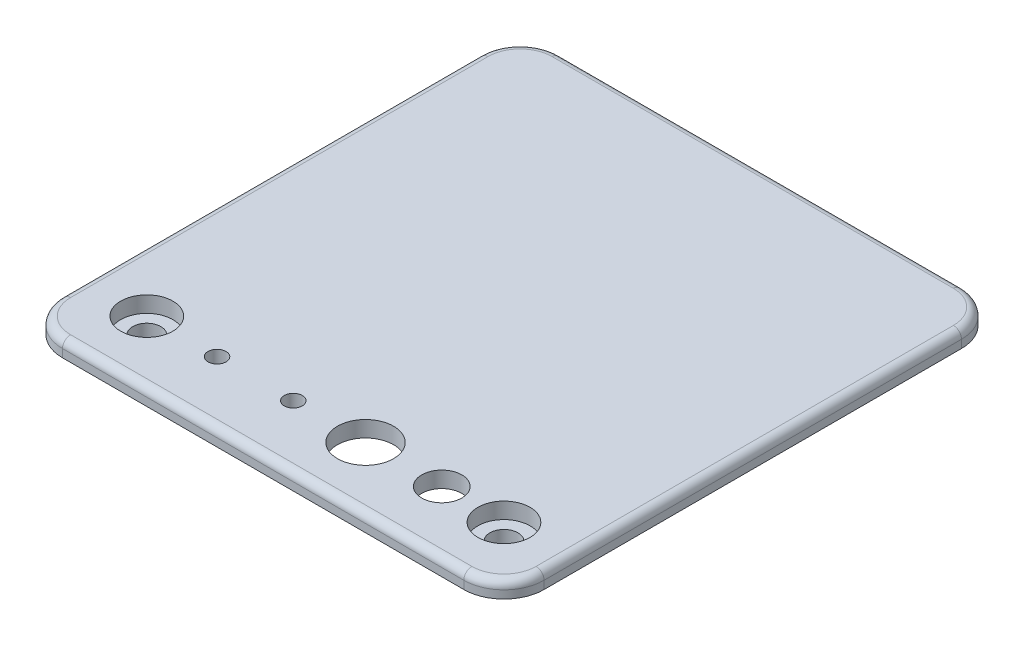
ISO-10303-21;
HEADER;
FILE_DESCRIPTION(('STEP AP214'),'2;1');
FILE_NAME('part.step','',(''),(''),'','','');
FILE_SCHEMA(('AUTOMOTIVE_DESIGN { 1 0 10303 214 1 1 1 1 }'));
ENDSEC;
DATA;
#1=APPLICATION_CONTEXT('core data for automotive mechanical design processes');
#2=APPLICATION_PROTOCOL_DEFINITION('international standard','automotive_design',2000,#1);
#3=PRODUCT_CONTEXT('',#1,'mechanical');
#4=PRODUCT('Part','Part','',(#3));
#5=PRODUCT_RELATED_PRODUCT_CATEGORY('part','',(#4));
#6=PRODUCT_DEFINITION_FORMATION('','',#4);
#7=PRODUCT_DEFINITION_CONTEXT('part definition',#1,'design');
#8=PRODUCT_DEFINITION('design','',#6,#7);
#9=PRODUCT_DEFINITION_SHAPE('','',#8);
#10=(LENGTH_UNIT() NAMED_UNIT(*) SI_UNIT(.MILLI.,.METRE.));
#11=(NAMED_UNIT(*) PLANE_ANGLE_UNIT() SI_UNIT($,.RADIAN.));
#12=(NAMED_UNIT(*) SI_UNIT($,.STERADIAN.) SOLID_ANGLE_UNIT());
#13=UNCERTAINTY_MEASURE_WITH_UNIT(LENGTH_MEASURE(1.E-05),#10,'distance_accuracy_value','');
#14=(GEOMETRIC_REPRESENTATION_CONTEXT(3) GLOBAL_UNCERTAINTY_ASSIGNED_CONTEXT((#13)) GLOBAL_UNIT_ASSIGNED_CONTEXT((#10,
#11,#12)) REPRESENTATION_CONTEXT('',''));
#15=CARTESIAN_POINT('',(0.,0.,0.));
#16=DIRECTION('',(0.,0.,1.));
#17=DIRECTION('',(1.,0.,0.));
#18=AXIS2_PLACEMENT_3D('',#15,#16,#17);
#19=CARTESIAN_POINT('',(25.,0.,26.));
#20=DIRECTION('',(0.,1.,0.));
#21=DIRECTION('',(0.,0.,1.));
#22=AXIS2_PLACEMENT_3D('',#19,#20,#21);
#23=PLANE('',#22);
#24=CARTESIAN_POINT('',(5.,0.,23.25));
#25=DIRECTION('',(0.,1.,0.));
#26=DIRECTION('',(0.,0.,1.));
#27=AXIS2_PLACEMENT_3D('',#24,#25,#26);
#28=CIRCLE('',#27,3.5);
#29=CARTESIAN_POINT('',(5.,0.,26.75));
#30=VERTEX_POINT('',#29);
#31=EDGE_CURVE('E270',#30,#30,#28,.T.);
#32=ORIENTED_EDGE('',*,*,#31,.T.);
#33=EDGE_LOOP('',(#32));
#34=FACE_BOUND('',#33,.T.);
#35=CARTESIAN_POINT('',(14.5,0.,23.25));
#36=DIRECTION('',(0.,1.,0.));
#37=DIRECTION('',(0.,0.,1.));
#38=AXIS2_PLACEMENT_3D('',#35,#36,#37);
#39=CIRCLE('',#38,2.5);
#40=CARTESIAN_POINT('',(14.5,0.,25.75));
#41=VERTEX_POINT('',#40);
#42=EDGE_CURVE('E274',#41,#41,#39,.T.);
#43=ORIENTED_EDGE('',*,*,#42,.T.);
#44=EDGE_LOOP('',(#43));
#45=FACE_BOUND('',#44,.T.);
#46=CARTESIAN_POINT('',(-4.,0.,23.25));
#47=DIRECTION('',(0.,1.,0.));
#48=DIRECTION('',(0.,0.,1.));
#49=AXIS2_PLACEMENT_3D('',#46,#47,#48);
#50=CIRCLE('',#49,1.125);
#51=CARTESIAN_POINT('',(-4.,0.,24.375));
#52=VERTEX_POINT('',#51);
#53=EDGE_CURVE('E280',#52,#52,#50,.T.);
#54=ORIENTED_EDGE('',*,*,#53,.T.);
#55=EDGE_LOOP('',(#54));
#56=FACE_BOUND('',#55,.T.);
#57=CARTESIAN_POINT('',(-13.5,0.,23.25));
#58=DIRECTION('',(0.,1.,0.));
#59=DIRECTION('',(0.,0.,1.));
#60=AXIS2_PLACEMENT_3D('',#57,#58,#59);
#61=CIRCLE('',#60,1.125);
#62=CARTESIAN_POINT('',(-13.5,0.,24.375));
#63=VERTEX_POINT('',#62);
#64=EDGE_CURVE('E286',#63,#63,#61,.T.);
#65=ORIENTED_EDGE('',*,*,#64,.T.);
#66=EDGE_LOOP('',(#65));
#67=FACE_BOUND('',#66,.T.);
#68=CARTESIAN_POINT('',(25.,0.,26.));
#69=DIRECTION('',(0.,1.,0.));
#70=DIRECTION('',(0.,0.,1.));
#71=AXIS2_PLACEMENT_3D('',#68,#69,#70);
#72=CIRCLE('',#71,5.);
#73=CARTESIAN_POINT('',(25.,0.,31.));
#74=VERTEX_POINT('',#73);
#75=CARTESIAN_POINT('',(30.,0.,26.));
#76=VERTEX_POINT('',#75);
#77=EDGE_CURVE('E292',#74,#76,#72,.T.);
#78=ORIENTED_EDGE('',*,*,#77,.F.);
#79=DIRECTION('',(1.,0.,0.));
#80=VECTOR('',#79,1.);
#81=CARTESIAN_POINT('',(25.,0.,31.));
#82=LINE('',#81,#80);
#83=CARTESIAN_POINT('',(-25.,0.,31.));
#84=VERTEX_POINT('',#83);
#85=EDGE_CURVE('E315',#84,#74,#82,.T.);
#86=ORIENTED_EDGE('',*,*,#85,.F.);
#87=CARTESIAN_POINT('',(-25.,0.,26.));
#88=DIRECTION('',(0.,1.,0.));
#89=DIRECTION('',(0.,0.,1.));
#90=AXIS2_PLACEMENT_3D('',#87,#88,#89);
#91=CIRCLE('',#90,5.);
#92=CARTESIAN_POINT('',(-30.,0.,26.));
#93=VERTEX_POINT('',#92);
#94=EDGE_CURVE('E312',#93,#84,#91,.T.);
#95=ORIENTED_EDGE('',*,*,#94,.F.);
#96=DIRECTION('',(0.,0.,1.));
#97=VECTOR('',#96,1.);
#98=CARTESIAN_POINT('',(-30.,0.,26.));
#99=LINE('',#98,#97);
#100=CARTESIAN_POINT('',(-30.,0.,-26.));
#101=VERTEX_POINT('',#100);
#102=EDGE_CURVE('E309',#101,#93,#99,.T.);
#103=ORIENTED_EDGE('',*,*,#102,.F.);
#104=CARTESIAN_POINT('',(-25.,0.,-26.));
#105=DIRECTION('',(0.,1.,0.));
#106=DIRECTION('',(0.,0.,-1.));
#107=AXIS2_PLACEMENT_3D('',#104,#105,#106);
#108=CIRCLE('',#107,5.);
#109=CARTESIAN_POINT('',(-25.,0.,-31.));
#110=VERTEX_POINT('',#109);
#111=EDGE_CURVE('E306',#110,#101,#108,.T.);
#112=ORIENTED_EDGE('',*,*,#111,.F.);
#113=DIRECTION('',(-1.,0.,0.));
#114=VECTOR('',#113,1.);
#115=CARTESIAN_POINT('',(25.,0.,-31.));
#116=LINE('',#115,#114);
#117=CARTESIAN_POINT('',(25.,0.,-31.));
#118=VERTEX_POINT('',#117);
#119=EDGE_CURVE('E303',#118,#110,#116,.T.);
#120=ORIENTED_EDGE('',*,*,#119,.F.);
#121=CARTESIAN_POINT('',(25.,0.,-26.));
#122=DIRECTION('',(0.,1.,0.));
#123=DIRECTION('',(0.,0.,1.));
#124=AXIS2_PLACEMENT_3D('',#121,#122,#123);
#125=CIRCLE('',#124,5.);
#126=CARTESIAN_POINT('',(30.,0.,-26.));
#127=VERTEX_POINT('',#126);
#128=EDGE_CURVE('E300',#127,#118,#125,.T.);
#129=ORIENTED_EDGE('',*,*,#128,.F.);
#130=DIRECTION('',(0.,0.,-1.));
#131=VECTOR('',#130,1.);
#132=CARTESIAN_POINT('',(30.,0.,26.));
#133=LINE('',#132,#131);
#134=EDGE_CURVE('E297',#76,#127,#133,.T.);
#135=ORIENTED_EDGE('',*,*,#134,.F.);
#136=EDGE_LOOP('',(#78,#86,#95,#103,#112,#120,#129,#135));
#137=FACE_BOUND('',#136,.T.);
#138=CARTESIAN_POINT('',(-22.25,0.,23.25));
#139=DIRECTION('',(0.,1.,0.));
#140=DIRECTION('',(0.,0.,1.));
#141=AXIS2_PLACEMENT_3D('',#138,#139,#140);
#142=CIRCLE('',#141,4.);
#143=CARTESIAN_POINT('',(-22.25,0.,27.25));
#144=VERTEX_POINT('',#143);
#145=EDGE_CURVE('E334',#144,#144,#142,.F.);
#146=ORIENTED_EDGE('',*,*,#145,.F.);
#147=EDGE_LOOP('',(#146));
#148=FACE_BOUND('',#147,.T.);
#149=CARTESIAN_POINT('',(22.25,0.,23.25));
#150=DIRECTION('',(0.,1.,0.));
#151=DIRECTION('',(0.,0.,1.));
#152=AXIS2_PLACEMENT_3D('',#149,#150,#151);
#153=CIRCLE('',#152,4.);
#154=CARTESIAN_POINT('',(22.25,0.,27.25));
#155=VERTEX_POINT('',#154);
#156=EDGE_CURVE('E337',#155,#155,#153,.F.);
#157=ORIENTED_EDGE('',*,*,#156,.F.);
#158=EDGE_LOOP('',(#157));
#159=FACE_BOUND('',#158,.T.);
#160=DIRECTION('',(0.,0.,1.));
#161=VECTOR('',#160,1.);
#162=CARTESIAN_POINT('',(10.,0.,-29.));
#163=LINE('',#162,#161);
#164=CARTESIAN_POINT('',(10.,0.,-29.));
#165=VERTEX_POINT('',#164);
#166=CARTESIAN_POINT('',(10.,0.,-26.25));
#167=VERTEX_POINT('',#166);
#168=EDGE_CURVE('E213',#165,#167,#163,.T.);
#169=ORIENTED_EDGE('',*,*,#168,.F.);
#170=DIRECTION('',(1.,0.,0.));
#171=VECTOR('',#170,1.);
#172=CARTESIAN_POINT('',(-9.99999999999999,0.,-29.));
#173=LINE('',#172,#171);
#174=CARTESIAN_POINT('',(8.00000000000001,0.,-29.));
#175=VERTEX_POINT('',#174);
#176=EDGE_CURVE('E231',#175,#165,#173,.T.);
#177=ORIENTED_EDGE('',*,*,#176,.F.);
#178=DIRECTION('',(0.,0.,1.));
#179=VECTOR('',#178,1.);
#180=CARTESIAN_POINT('',(8.00000000000001,0.,-29.));
#181=LINE('',#180,#179);
#182=CARTESIAN_POINT('',(8.00000000000001,0.,-27.));
#183=VERTEX_POINT('',#182);
#184=EDGE_CURVE('E200',#175,#183,#181,.T.);
#185=ORIENTED_EDGE('',*,*,#184,.T.);
#186=DIRECTION('',(1.,0.,0.));
#187=VECTOR('',#186,1.);
#188=CARTESIAN_POINT('',(-7.99999999999999,0.,-27.));
#189=LINE('',#188,#187);
#190=CARTESIAN_POINT('',(-7.99999999999999,0.,-27.));
#191=VERTEX_POINT('',#190);
#192=EDGE_CURVE('E184',#191,#183,#189,.T.);
#193=ORIENTED_EDGE('',*,*,#192,.F.);
#194=DIRECTION('',(0.,0.,1.));
#195=VECTOR('',#194,1.);
#196=CARTESIAN_POINT('',(-7.99999999999999,0.,-29.));
#197=LINE('',#196,#195);
#198=CARTESIAN_POINT('',(-7.99999999999999,0.,-29.));
#199=VERTEX_POINT('',#198);
#200=EDGE_CURVE('E193',#199,#191,#197,.T.);
#201=ORIENTED_EDGE('',*,*,#200,.F.);
#202=CARTESIAN_POINT('',(-9.99999999999999,0.,-29.));
#203=VERTEX_POINT('',#202);
#204=EDGE_CURVE('E219',#203,#199,#173,.T.);
#205=ORIENTED_EDGE('',*,*,#204,.F.);
#206=DIRECTION('',(0.,0.,-1.));
#207=VECTOR('',#206,1.);
#208=CARTESIAN_POINT('',(-9.99999999999999,0.,-29.));
#209=LINE('',#208,#207);
#210=CARTESIAN_POINT('',(-9.99999999999999,0.,-26.25));
#211=VERTEX_POINT('',#210);
#212=EDGE_CURVE('E228',#211,#203,#209,.T.);
#213=ORIENTED_EDGE('',*,*,#212,.F.);
#214=DIRECTION('',(-1.,0.,0.));
#215=VECTOR('',#214,1.);
#216=CARTESIAN_POINT('',(-9.99999999999999,0.,-26.25));
#217=LINE('',#216,#215);
#218=EDGE_CURVE('E225',#167,#211,#217,.T.);
#219=ORIENTED_EDGE('',*,*,#218,.F.);
#220=EDGE_LOOP('',(#169,#177,#185,#193,#201,#205,#213,#219));
#221=FACE_BOUND('',#220,.T.);
#222=ADVANCED_FACE('F38',(#34,#45,#56,#67,#137,#148,#159,#221),#23,.F.);
#223=CARTESIAN_POINT('',(22.25,2.,23.25));
#224=DIRECTION('',(0.,-1.,0.));
#225=DIRECTION('',(0.,0.,-1.));
#226=AXIS2_PLACEMENT_3D('',#223,#224,#225);
#227=CYLINDRICAL_SURFACE('',#226,1.75);
#228=CARTESIAN_POINT('',(22.25,-2.,23.25));
#229=DIRECTION('',(0.,-1.,0.));
#230=DIRECTION('',(0.,0.,-1.));
#231=AXIS2_PLACEMENT_3D('',#228,#229,#230);
#232=CIRCLE('',#231,1.75);
#233=CARTESIAN_POINT('',(22.25,-2.,21.5));
#234=VERTEX_POINT('',#233);
#235=EDGE_CURVE('E248',#234,#234,#232,.T.);
#236=ORIENTED_EDGE('',*,*,#235,.T.);
#237=EDGE_LOOP('',(#236));
#238=FACE_BOUND('',#237,.T.);
#239=CARTESIAN_POINT('',(22.25,0.,23.25));
#240=DIRECTION('',(0.,1.,0.));
#241=DIRECTION('',(0.,0.,1.));
#242=AXIS2_PLACEMENT_3D('',#239,#240,#241);
#243=CIRCLE('',#242,1.75);
#244=CARTESIAN_POINT('',(22.25,0.,25.));
#245=VERTEX_POINT('',#244);
#246=EDGE_CURVE('E252',#245,#245,#243,.F.);
#247=ORIENTED_EDGE('',*,*,#246,.F.);
#248=EDGE_LOOP('',(#247));
#249=FACE_BOUND('',#248,.T.);
#250=ADVANCED_FACE('F480',(#238,#249),#227,.F.);
#251=CARTESIAN_POINT('',(-22.25,2.,23.25));
#252=DIRECTION('',(0.,-1.,0.));
#253=DIRECTION('',(0.,0.,-1.));
#254=AXIS2_PLACEMENT_3D('',#251,#252,#253);
#255=CYLINDRICAL_SURFACE('',#254,1.75);
#256=CARTESIAN_POINT('',(-22.25,-2.,23.25));
#257=DIRECTION('',(0.,-1.,0.));
#258=DIRECTION('',(0.,0.,-1.));
#259=AXIS2_PLACEMENT_3D('',#256,#257,#258);
#260=CIRCLE('',#259,1.75);
#261=CARTESIAN_POINT('',(-22.25,-2.,21.5));
#262=VERTEX_POINT('',#261);
#263=EDGE_CURVE('E259',#262,#262,#260,.T.);
#264=ORIENTED_EDGE('',*,*,#263,.T.);
#265=EDGE_LOOP('',(#264));
#266=FACE_BOUND('',#265,.T.);
#267=CARTESIAN_POINT('',(-22.25,0.,23.25));
#268=DIRECTION('',(0.,1.,0.));
#269=DIRECTION('',(0.,0.,1.));
#270=AXIS2_PLACEMENT_3D('',#267,#268,#269);
#271=CIRCLE('',#270,1.75);
#272=CARTESIAN_POINT('',(-22.25,0.,25.));
#273=VERTEX_POINT('',#272);
#274=EDGE_CURVE('E241',#273,#273,#271,.F.);
#275=ORIENTED_EDGE('',*,*,#274,.F.);
#276=EDGE_LOOP('',(#275));
#277=FACE_BOUND('',#276,.T.);
#278=ADVANCED_FACE('F486',(#266,#277),#255,.F.);
#279=CARTESIAN_POINT('',(25.,2.,26.));
#280=DIRECTION('',(0.,1.,0.));
#281=DIRECTION('',(0.,0.,1.));
#282=AXIS2_PLACEMENT_3D('',#279,#280,#281);
#283=PLANE('',#282);
#284=DIRECTION('',(-1.,0.,0.));
#285=VECTOR('',#284,1.);
#286=CARTESIAN_POINT('',(-25.,2.,-30.));
#287=LINE('',#286,#285);
#288=CARTESIAN_POINT('',(25.,2.,-30.));
#289=VERTEX_POINT('',#288);
#290=CARTESIAN_POINT('',(-25.,2.,-30.));
#291=VERTEX_POINT('',#290);
#292=EDGE_CURVE('E370',#289,#291,#287,.T.);
#293=ORIENTED_EDGE('',*,*,#292,.T.);
#294=CARTESIAN_POINT('',(-25.,2.,-26.));
#295=DIRECTION('',(0.,1.,0.));
#296=DIRECTION('',(0.,0.,1.));
#297=AXIS2_PLACEMENT_3D('',#294,#295,#296);
#298=CIRCLE('',#297,4.);
#299=CARTESIAN_POINT('',(-29.,2.,-26.));
#300=VERTEX_POINT('',#299);
#301=EDGE_CURVE('E372',#291,#300,#298,.T.);
#302=ORIENTED_EDGE('',*,*,#301,.T.);
#303=DIRECTION('',(0.,0.,1.));
#304=VECTOR('',#303,1.);
#305=CARTESIAN_POINT('',(-29.,2.,26.));
#306=LINE('',#305,#304);
#307=CARTESIAN_POINT('',(-29.,2.,26.));
#308=VERTEX_POINT('',#307);
#309=EDGE_CURVE('E358',#300,#308,#306,.T.);
#310=ORIENTED_EDGE('',*,*,#309,.T.);
#311=CARTESIAN_POINT('',(-25.,2.,26.));
#312=DIRECTION('',(0.,1.,0.));
#313=DIRECTION('',(0.,0.,1.));
#314=AXIS2_PLACEMENT_3D('',#311,#312,#313);
#315=CIRCLE('',#314,4.);
#316=CARTESIAN_POINT('',(-25.,2.,30.));
#317=VERTEX_POINT('',#316);
#318=EDGE_CURVE('E360',#308,#317,#315,.T.);
#319=ORIENTED_EDGE('',*,*,#318,.T.);
#320=DIRECTION('',(1.,0.,0.));
#321=VECTOR('',#320,1.);
#322=CARTESIAN_POINT('',(25.,2.,30.));
#323=LINE('',#322,#321);
#324=CARTESIAN_POINT('',(25.,2.,30.));
#325=VERTEX_POINT('',#324);
#326=EDGE_CURVE('E362',#317,#325,#323,.T.);
#327=ORIENTED_EDGE('',*,*,#326,.T.);
#328=CARTESIAN_POINT('',(25.,2.,26.));
#329=DIRECTION('',(0.,1.,0.));
#330=DIRECTION('',(0.,0.,1.));
#331=AXIS2_PLACEMENT_3D('',#328,#329,#330);
#332=CIRCLE('',#331,4.);
#333=CARTESIAN_POINT('',(29.,2.,26.));
#334=VERTEX_POINT('',#333);
#335=EDGE_CURVE('E364',#325,#334,#332,.T.);
#336=ORIENTED_EDGE('',*,*,#335,.T.);
#337=DIRECTION('',(0.,0.,-1.));
#338=VECTOR('',#337,1.);
#339=CARTESIAN_POINT('',(29.,2.,-26.));
#340=LINE('',#339,#338);
#341=CARTESIAN_POINT('',(29.,2.,-26.));
#342=VERTEX_POINT('',#341);
#343=EDGE_CURVE('E366',#334,#342,#340,.T.);
#344=ORIENTED_EDGE('',*,*,#343,.T.);
#345=CARTESIAN_POINT('',(25.,2.,-26.));
#346=DIRECTION('',(0.,1.,0.));
#347=DIRECTION('',(0.,0.,1.));
#348=AXIS2_PLACEMENT_3D('',#345,#346,#347);
#349=CIRCLE('',#348,4.);
#350=EDGE_CURVE('E368',#342,#289,#349,.T.);
#351=ORIENTED_EDGE('',*,*,#350,.T.);
#352=EDGE_LOOP('',(#293,#302,#310,#319,#327,#336,#344,#351));
#353=FACE_BOUND('',#352,.T.);
#354=CARTESIAN_POINT('',(-22.25,2.,23.25));
#355=DIRECTION('',(0.,1.,0.));
#356=DIRECTION('',(0.,0.,1.));
#357=AXIS2_PLACEMENT_3D('',#354,#355,#356);
#358=CIRCLE('',#357,3.25);
#359=CARTESIAN_POINT('',(-22.25,2.,26.5));
#360=VERTEX_POINT('',#359);
#361=EDGE_CURVE('E245',#360,#360,#358,.T.);
#362=ORIENTED_EDGE('',*,*,#361,.F.);
#363=EDGE_LOOP('',(#362));
#364=FACE_BOUND('',#363,.T.);
#365=CARTESIAN_POINT('',(22.25,2.,23.25));
#366=DIRECTION('',(0.,1.,0.));
#367=DIRECTION('',(0.,0.,1.));
#368=AXIS2_PLACEMENT_3D('',#365,#366,#367);
#369=CIRCLE('',#368,3.25);
#370=CARTESIAN_POINT('',(22.25,2.,26.5));
#371=VERTEX_POINT('',#370);
#372=EDGE_CURVE('E240',#371,#371,#369,.T.);
#373=ORIENTED_EDGE('',*,*,#372,.F.);
#374=EDGE_LOOP('',(#373));
#375=FACE_BOUND('',#374,.T.);
#376=CARTESIAN_POINT('',(14.5,2.,23.25));
#377=DIRECTION('',(0.,1.,0.));
#378=DIRECTION('',(0.,0.,1.));
#379=AXIS2_PLACEMENT_3D('',#376,#377,#378);
#380=CIRCLE('',#379,2.5);
#381=CARTESIAN_POINT('',(14.5,2.,25.75));
#382=VERTEX_POINT('',#381);
#383=EDGE_CURVE('E277',#382,#382,#380,.T.);
#384=ORIENTED_EDGE('',*,*,#383,.F.);
#385=EDGE_LOOP('',(#384));
#386=FACE_BOUND('',#385,.T.);
#387=CARTESIAN_POINT('',(-13.5,2.,23.25));
#388=DIRECTION('',(0.,1.,0.));
#389=DIRECTION('',(0.,0.,1.));
#390=AXIS2_PLACEMENT_3D('',#387,#388,#389);
#391=CIRCLE('',#390,1.125);
#392=CARTESIAN_POINT('',(-13.5,2.,24.375));
#393=VERTEX_POINT('',#392);
#394=EDGE_CURVE('E289',#393,#393,#391,.T.);
#395=ORIENTED_EDGE('',*,*,#394,.F.);
#396=EDGE_LOOP('',(#395));
#397=FACE_BOUND('',#396,.T.);
#398=CARTESIAN_POINT('',(-4.,2.,23.25));
#399=DIRECTION('',(0.,1.,0.));
#400=DIRECTION('',(0.,0.,1.));
#401=AXIS2_PLACEMENT_3D('',#398,#399,#400);
#402=CIRCLE('',#401,1.125);
#403=CARTESIAN_POINT('',(-4.,2.,24.375));
#404=VERTEX_POINT('',#403);
#405=EDGE_CURVE('E283',#404,#404,#402,.T.);
#406=ORIENTED_EDGE('',*,*,#405,.F.);
#407=EDGE_LOOP('',(#406));
#408=FACE_BOUND('',#407,.T.);
#409=CARTESIAN_POINT('',(5.,2.,23.25));
#410=DIRECTION('',(0.,1.,0.));
#411=DIRECTION('',(0.,0.,1.));
#412=AXIS2_PLACEMENT_3D('',#409,#410,#411);
#413=CIRCLE('',#412,3.5);
#414=CARTESIAN_POINT('',(5.,2.,26.75));
#415=VERTEX_POINT('',#414);
#416=EDGE_CURVE('E271',#415,#415,#413,.T.);
#417=ORIENTED_EDGE('',*,*,#416,.F.);
#418=EDGE_LOOP('',(#417));
#419=FACE_BOUND('',#418,.T.);
#420=ADVANCED_FACE('F448',(#353,#364,#375,#386,#397,#408,#419),#283,.T.);
#421=CARTESIAN_POINT('',(25.,2.,26.));
#422=DIRECTION('',(0.,-1.,0.));
#423=DIRECTION('',(0.,0.,-1.));
#424=AXIS2_PLACEMENT_3D('',#421,#422,#423);
#425=CYLINDRICAL_SURFACE('',#424,5.);
#426=DIRECTION('',(0.,-1.,0.));
#427=VECTOR('',#426,1.);
#428=CARTESIAN_POINT('',(30.,2.,26.));
#429=LINE('',#428,#427);
#430=CARTESIAN_POINT('',(30.,1.,26.));
#431=VERTEX_POINT('',#430);
#432=EDGE_CURVE('E332',#431,#76,#429,.T.);
#433=ORIENTED_EDGE('',*,*,#432,.F.);
#434=CARTESIAN_POINT('',(25.,1.,26.));
#435=DIRECTION('',(0.,1.,0.));
#436=DIRECTION('',(0.,0.,1.));
#437=AXIS2_PLACEMENT_3D('',#434,#435,#436);
#438=CIRCLE('',#437,5.);
#439=CARTESIAN_POINT('',(25.,1.,31.));
#440=VERTEX_POINT('',#439);
#441=EDGE_CURVE('E384',#431,#440,#438,.F.);
#442=ORIENTED_EDGE('',*,*,#441,.T.);
#443=DIRECTION('',(0.,-1.,0.));
#444=VECTOR('',#443,1.);
#445=CARTESIAN_POINT('',(25.,2.,31.));
#446=LINE('',#445,#444);
#447=EDGE_CURVE('E318',#440,#74,#446,.T.);
#448=ORIENTED_EDGE('',*,*,#447,.T.);
#449=ORIENTED_EDGE('',*,*,#77,.T.);
#450=EDGE_LOOP('',(#433,#442,#448,#449));
#451=FACE_BOUND('',#450,.T.);
#452=ADVANCED_FACE('F420',(#451),#425,.T.);
#453=CARTESIAN_POINT('',(30.,2.,26.));
#454=DIRECTION('',(-1.,0.,0.));
#455=DIRECTION('',(0.,0.,1.));
#456=AXIS2_PLACEMENT_3D('',#453,#454,#455);
#457=PLANE('',#456);
#458=DIRECTION('',(0.,-1.,0.));
#459=VECTOR('',#458,1.);
#460=CARTESIAN_POINT('',(30.,2.,-26.));
#461=LINE('',#460,#459);
#462=CARTESIAN_POINT('',(30.,1.,-26.));
#463=VERTEX_POINT('',#462);
#464=EDGE_CURVE('E330',#463,#127,#461,.T.);
#465=ORIENTED_EDGE('',*,*,#464,.F.);
#466=DIRECTION('',(0.,0.,-1.));
#467=VECTOR('',#466,1.);
#468=CARTESIAN_POINT('',(30.,1.,26.));
#469=LINE('',#468,#467);
#470=EDGE_CURVE('E382',#463,#431,#469,.F.);
#471=ORIENTED_EDGE('',*,*,#470,.T.);
#472=ORIENTED_EDGE('',*,*,#432,.T.);
#473=ORIENTED_EDGE('',*,*,#134,.T.);
#474=EDGE_LOOP('',(#465,#471,#472,#473));
#475=FACE_BOUND('',#474,.T.);
#476=ADVANCED_FACE('F432',(#475),#457,.F.);
#477=CARTESIAN_POINT('',(25.,2.,-26.));
#478=DIRECTION('',(0.,-1.,0.));
#479=DIRECTION('',(0.,0.,-1.));
#480=AXIS2_PLACEMENT_3D('',#477,#478,#479);
#481=CYLINDRICAL_SURFACE('',#480,5.);
#482=DIRECTION('',(0.,-1.,0.));
#483=VECTOR('',#482,1.);
#484=CARTESIAN_POINT('',(25.,2.,-31.));
#485=LINE('',#484,#483);
#486=CARTESIAN_POINT('',(25.,1.,-31.));
#487=VERTEX_POINT('',#486);
#488=EDGE_CURVE('E328',#487,#118,#485,.T.);
#489=ORIENTED_EDGE('',*,*,#488,.F.);
#490=CARTESIAN_POINT('',(25.,1.,-26.));
#491=DIRECTION('',(0.,1.,0.));
#492=DIRECTION('',(0.,0.,1.));
#493=AXIS2_PLACEMENT_3D('',#490,#491,#492);
#494=CIRCLE('',#493,5.);
#495=EDGE_CURVE('E380',#487,#463,#494,.F.);
#496=ORIENTED_EDGE('',*,*,#495,.T.);
#497=ORIENTED_EDGE('',*,*,#464,.T.);
#498=ORIENTED_EDGE('',*,*,#128,.T.);
#499=EDGE_LOOP('',(#489,#496,#497,#498));
#500=FACE_BOUND('',#499,.T.);
#501=ADVANCED_FACE('F435',(#500),#481,.T.);
#502=CARTESIAN_POINT('',(25.,2.,-31.));
#503=DIRECTION('',(0.,0.,1.));
#504=DIRECTION('',(1.,0.,0.));
#505=AXIS2_PLACEMENT_3D('',#502,#503,#504);
#506=PLANE('',#505);
#507=DIRECTION('',(0.,-1.,0.));
#508=VECTOR('',#507,1.);
#509=CARTESIAN_POINT('',(-25.,2.,-31.));
#510=LINE('',#509,#508);
#511=CARTESIAN_POINT('',(-25.,1.,-31.));
#512=VERTEX_POINT('',#511);
#513=EDGE_CURVE('E326',#512,#110,#510,.T.);
#514=ORIENTED_EDGE('',*,*,#513,.F.);
#515=DIRECTION('',(-1.,0.,0.));
#516=VECTOR('',#515,1.);
#517=CARTESIAN_POINT('',(25.,1.,-31.));
#518=LINE('',#517,#516);
#519=EDGE_CURVE('E378',#512,#487,#518,.F.);
#520=ORIENTED_EDGE('',*,*,#519,.T.);
#521=ORIENTED_EDGE('',*,*,#488,.T.);
#522=ORIENTED_EDGE('',*,*,#119,.T.);
#523=EDGE_LOOP('',(#514,#520,#521,#522));
#524=FACE_BOUND('',#523,.T.);
#525=ADVANCED_FACE('F503',(#524),#506,.F.);
#526=CARTESIAN_POINT('',(-25.,2.,-26.));
#527=DIRECTION('',(0.,-1.,0.));
#528=DIRECTION('',(0.,0.,-1.));
#529=AXIS2_PLACEMENT_3D('',#526,#527,#528);
#530=CYLINDRICAL_SURFACE('',#529,5.);
#531=DIRECTION('',(0.,-1.,0.));
#532=VECTOR('',#531,1.);
#533=CARTESIAN_POINT('',(-30.,2.,-26.));
#534=LINE('',#533,#532);
#535=CARTESIAN_POINT('',(-30.,1.,-26.));
#536=VERTEX_POINT('',#535);
#537=EDGE_CURVE('E324',#536,#101,#534,.T.);
#538=ORIENTED_EDGE('',*,*,#537,.F.);
#539=CARTESIAN_POINT('',(-25.,1.,-26.));
#540=DIRECTION('',(0.,1.,0.));
#541=DIRECTION('',(0.,0.,1.));
#542=AXIS2_PLACEMENT_3D('',#539,#540,#541);
#543=CIRCLE('',#542,5.);
#544=EDGE_CURVE('E375',#536,#512,#543,.F.);
#545=ORIENTED_EDGE('',*,*,#544,.T.);
#546=ORIENTED_EDGE('',*,*,#513,.T.);
#547=ORIENTED_EDGE('',*,*,#111,.T.);
#548=EDGE_LOOP('',(#538,#545,#546,#547));
#549=FACE_BOUND('',#548,.T.);
#550=ADVANCED_FACE('F466',(#549),#530,.T.);
#551=CARTESIAN_POINT('',(-30.,2.,26.));
#552=DIRECTION('',(1.,0.,0.));
#553=DIRECTION('',(0.,0.,-1.));
#554=AXIS2_PLACEMENT_3D('',#551,#552,#553);
#555=PLANE('',#554);
#556=DIRECTION('',(0.,-1.,0.));
#557=VECTOR('',#556,1.);
#558=CARTESIAN_POINT('',(-30.,2.,26.));
#559=LINE('',#558,#557);
#560=CARTESIAN_POINT('',(-30.,1.,26.));
#561=VERTEX_POINT('',#560);
#562=EDGE_CURVE('E322',#561,#93,#559,.T.);
#563=ORIENTED_EDGE('',*,*,#562,.F.);
#564=DIRECTION('',(0.,0.,1.));
#565=VECTOR('',#564,1.);
#566=CARTESIAN_POINT('',(-30.,1.,-26.));
#567=LINE('',#566,#565);
#568=EDGE_CURVE('E11',#561,#536,#567,.F.);
#569=ORIENTED_EDGE('',*,*,#568,.T.);
#570=ORIENTED_EDGE('',*,*,#537,.T.);
#571=ORIENTED_EDGE('',*,*,#102,.T.);
#572=EDGE_LOOP('',(#563,#569,#570,#571));
#573=FACE_BOUND('',#572,.T.);
#574=ADVANCED_FACE('F463',(#573),#555,.F.);
#575=CARTESIAN_POINT('',(-25.,2.,26.));
#576=DIRECTION('',(0.,-1.,0.));
#577=DIRECTION('',(0.,0.,-1.));
#578=AXIS2_PLACEMENT_3D('',#575,#576,#577);
#579=CYLINDRICAL_SURFACE('',#578,5.);
#580=DIRECTION('',(0.,-1.,0.));
#581=VECTOR('',#580,1.);
#582=CARTESIAN_POINT('',(-25.,2.,31.));
#583=LINE('',#582,#581);
#584=CARTESIAN_POINT('',(-25.,1.,31.));
#585=VERTEX_POINT('',#584);
#586=EDGE_CURVE('E320',#585,#84,#583,.T.);
#587=ORIENTED_EDGE('',*,*,#586,.F.);
#588=CARTESIAN_POINT('',(-25.,1.,26.));
#589=DIRECTION('',(0.,1.,0.));
#590=DIRECTION('',(0.,0.,1.));
#591=AXIS2_PLACEMENT_3D('',#588,#589,#590);
#592=CIRCLE('',#591,5.);
#593=EDGE_CURVE('E47',#585,#561,#592,.F.);
#594=ORIENTED_EDGE('',*,*,#593,.T.);
#595=ORIENTED_EDGE('',*,*,#562,.T.);
#596=ORIENTED_EDGE('',*,*,#94,.T.);
#597=EDGE_LOOP('',(#587,#594,#595,#596));
#598=FACE_BOUND('',#597,.T.);
#599=ADVANCED_FACE('F496',(#598),#579,.T.);
#600=CARTESIAN_POINT('',(25.,2.,31.));
#601=DIRECTION('',(0.,0.,-1.));
#602=DIRECTION('',(-1.,0.,0.));
#603=AXIS2_PLACEMENT_3D('',#600,#601,#602);
#604=PLANE('',#603);
#605=ORIENTED_EDGE('',*,*,#447,.F.);
#606=DIRECTION('',(1.,0.,0.));
#607=VECTOR('',#606,1.);
#608=CARTESIAN_POINT('',(-25.,1.,31.));
#609=LINE('',#608,#607);
#610=EDGE_CURVE('E62',#440,#585,#609,.F.);
#611=ORIENTED_EDGE('',*,*,#610,.T.);
#612=ORIENTED_EDGE('',*,*,#586,.T.);
#613=ORIENTED_EDGE('',*,*,#85,.T.);
#614=EDGE_LOOP('',(#605,#611,#612,#613));
#615=FACE_BOUND('',#614,.T.);
#616=ADVANCED_FACE('F421',(#615),#604,.F.);
#617=CARTESIAN_POINT('',(-13.5,2.,23.25));
#618=DIRECTION('',(0.,-1.,0.));
#619=DIRECTION('',(0.,0.,-1.));
#620=AXIS2_PLACEMENT_3D('',#617,#618,#619);
#621=CYLINDRICAL_SURFACE('',#620,1.125);
#622=ORIENTED_EDGE('',*,*,#394,.T.);
#623=EDGE_LOOP('',(#622));
#624=FACE_BOUND('',#623,.T.);
#625=ORIENTED_EDGE('',*,*,#64,.F.);
#626=EDGE_LOOP('',(#625));
#627=FACE_BOUND('',#626,.T.);
#628=ADVANCED_FACE('F495',(#624,#627),#621,.F.);
#629=CARTESIAN_POINT('',(-4.,2.,23.25));
#630=DIRECTION('',(0.,-1.,0.));
#631=DIRECTION('',(0.,0.,-1.));
#632=AXIS2_PLACEMENT_3D('',#629,#630,#631);
#633=CYLINDRICAL_SURFACE('',#632,1.125);
#634=ORIENTED_EDGE('',*,*,#405,.T.);
#635=EDGE_LOOP('',(#634));
#636=FACE_BOUND('',#635,.T.);
#637=ORIENTED_EDGE('',*,*,#53,.F.);
#638=EDGE_LOOP('',(#637));
#639=FACE_BOUND('',#638,.T.);
#640=ADVANCED_FACE('F611',(#636,#639),#633,.F.);
#641=CARTESIAN_POINT('',(14.5,2.,23.25));
#642=DIRECTION('',(0.,-1.,0.));
#643=DIRECTION('',(0.,0.,-1.));
#644=AXIS2_PLACEMENT_3D('',#641,#642,#643);
#645=CYLINDRICAL_SURFACE('',#644,2.5);
#646=ORIENTED_EDGE('',*,*,#383,.T.);
#647=EDGE_LOOP('',(#646));
#648=FACE_BOUND('',#647,.T.);
#649=ORIENTED_EDGE('',*,*,#42,.F.);
#650=EDGE_LOOP('',(#649));
#651=FACE_BOUND('',#650,.T.);
#652=ADVANCED_FACE('F607',(#648,#651),#645,.F.);
#653=CARTESIAN_POINT('',(5.,2.,23.25));
#654=DIRECTION('',(0.,-1.,0.));
#655=DIRECTION('',(0.,0.,-1.));
#656=AXIS2_PLACEMENT_3D('',#653,#654,#655);
#657=CYLINDRICAL_SURFACE('',#656,3.5);
#658=ORIENTED_EDGE('',*,*,#416,.T.);
#659=EDGE_LOOP('',(#658));
#660=FACE_BOUND('',#659,.T.);
#661=ORIENTED_EDGE('',*,*,#31,.F.);
#662=EDGE_LOOP('',(#661));
#663=FACE_BOUND('',#662,.T.);
#664=ADVANCED_FACE('F603',(#660,#663),#657,.F.);
#665=CARTESIAN_POINT('',(-22.25,-2.,23.25));
#666=DIRECTION('',(0.,1.,0.));
#667=DIRECTION('',(0.,0.,1.));
#668=AXIS2_PLACEMENT_3D('',#665,#666,#667);
#669=CYLINDRICAL_SURFACE('',#668,4.);
#670=CARTESIAN_POINT('',(-22.25,-2.,23.25));
#671=DIRECTION('',(0.,-1.,0.));
#672=DIRECTION('',(0.,0.,-1.));
#673=AXIS2_PLACEMENT_3D('',#670,#671,#672);
#674=CIRCLE('',#673,4.);
#675=CARTESIAN_POINT('',(-22.25,-2.,19.25));
#676=VERTEX_POINT('',#675);
#677=EDGE_CURVE('E267',#676,#676,#674,.T.);
#678=ORIENTED_EDGE('',*,*,#677,.F.);
#679=EDGE_LOOP('',(#678));
#680=FACE_BOUND('',#679,.T.);
#681=ORIENTED_EDGE('',*,*,#145,.T.);
#682=EDGE_LOOP('',(#681));
#683=FACE_BOUND('',#682,.T.);
#684=ADVANCED_FACE('F599',(#680,#683),#669,.T.);
#685=CARTESIAN_POINT('',(0.,-2.,0.));
#686=DIRECTION('',(0.,-1.,0.));
#687=DIRECTION('',(0.,0.,-1.));
#688=AXIS2_PLACEMENT_3D('',#685,#686,#687);
#689=PLANE('',#688);
#690=ORIENTED_EDGE('',*,*,#263,.F.);
#691=EDGE_LOOP('',(#690));
#692=FACE_BOUND('',#691,.T.);
#693=ORIENTED_EDGE('',*,*,#677,.T.);
#694=EDGE_LOOP('',(#693));
#695=FACE_BOUND('',#694,.T.);
#696=ADVANCED_FACE('F595',(#692,#695),#689,.T.);
#697=CARTESIAN_POINT('',(22.25,-2.,23.25));
#698=DIRECTION('',(0.,1.,0.));
#699=DIRECTION('',(0.,0.,1.));
#700=AXIS2_PLACEMENT_3D('',#697,#698,#699);
#701=CYLINDRICAL_SURFACE('',#700,4.);
#702=CARTESIAN_POINT('',(22.25,-2.,23.25));
#703=DIRECTION('',(0.,-1.,0.));
#704=DIRECTION('',(0.,0.,-1.));
#705=AXIS2_PLACEMENT_3D('',#702,#703,#704);
#706=CIRCLE('',#705,4.);
#707=CARTESIAN_POINT('',(22.25,-2.,19.25));
#708=VERTEX_POINT('',#707);
#709=EDGE_CURVE('E262',#708,#708,#706,.T.);
#710=ORIENTED_EDGE('',*,*,#709,.F.);
#711=EDGE_LOOP('',(#710));
#712=FACE_BOUND('',#711,.T.);
#713=ORIENTED_EDGE('',*,*,#156,.T.);
#714=EDGE_LOOP('',(#713));
#715=FACE_BOUND('',#714,.T.);
#716=ADVANCED_FACE('F591',(#712,#715),#701,.T.);
#717=CARTESIAN_POINT('',(0.,-2.,0.));
#718=DIRECTION('',(0.,-1.,0.));
#719=DIRECTION('',(0.,0.,-1.));
#720=AXIS2_PLACEMENT_3D('',#717,#718,#719);
#721=PLANE('',#720);
#722=ORIENTED_EDGE('',*,*,#235,.F.);
#723=EDGE_LOOP('',(#722));
#724=FACE_BOUND('',#723,.T.);
#725=ORIENTED_EDGE('',*,*,#709,.T.);
#726=EDGE_LOOP('',(#725));
#727=FACE_BOUND('',#726,.T.);
#728=ADVANCED_FACE('F578',(#724,#727),#721,.T.);
#729=CARTESIAN_POINT('',(-22.25,0.,23.25));
#730=DIRECTION('',(0.,1.,0.));
#731=DIRECTION('',(0.,0.,1.));
#732=AXIS2_PLACEMENT_3D('',#729,#730,#731);
#733=CYLINDRICAL_SURFACE('',#732,3.25);
#734=CARTESIAN_POINT('',(-22.25,0.,23.25));
#735=DIRECTION('',(0.,1.,0.));
#736=DIRECTION('',(0.,0.,1.));
#737=AXIS2_PLACEMENT_3D('',#734,#735,#736);
#738=CIRCLE('',#737,3.25);
#739=CARTESIAN_POINT('',(-22.25,0.,26.5));
#740=VERTEX_POINT('',#739);
#741=EDGE_CURVE('E244',#740,#740,#738,.T.);
#742=ORIENTED_EDGE('',*,*,#741,.F.);
#743=EDGE_LOOP('',(#742));
#744=FACE_BOUND('',#743,.T.);
#745=ORIENTED_EDGE('',*,*,#361,.T.);
#746=EDGE_LOOP('',(#745));
#747=FACE_BOUND('',#746,.T.);
#748=ADVANCED_FACE('F574',(#744,#747),#733,.F.);
#749=CARTESIAN_POINT('',(0.,0.,0.));
#750=DIRECTION('',(0.,1.,0.));
#751=DIRECTION('',(0.,0.,1.));
#752=AXIS2_PLACEMENT_3D('',#749,#750,#751);
#753=PLANE('',#752);
#754=ORIENTED_EDGE('',*,*,#274,.T.);
#755=EDGE_LOOP('',(#754));
#756=FACE_BOUND('',#755,.T.);
#757=ORIENTED_EDGE('',*,*,#741,.T.);
#758=EDGE_LOOP('',(#757));
#759=FACE_BOUND('',#758,.T.);
#760=ADVANCED_FACE('F570',(#756,#759),#753,.T.);
#761=CARTESIAN_POINT('',(22.25,0.,23.25));
#762=DIRECTION('',(0.,1.,0.));
#763=DIRECTION('',(0.,0.,1.));
#764=AXIS2_PLACEMENT_3D('',#761,#762,#763);
#765=CYLINDRICAL_SURFACE('',#764,3.25);
#766=CARTESIAN_POINT('',(22.25,0.,23.25));
#767=DIRECTION('',(0.,1.,0.));
#768=DIRECTION('',(0.,0.,1.));
#769=AXIS2_PLACEMENT_3D('',#766,#767,#768);
#770=CIRCLE('',#769,3.25);
#771=CARTESIAN_POINT('',(22.25,0.,26.5));
#772=VERTEX_POINT('',#771);
#773=EDGE_CURVE('E251',#772,#772,#770,.T.);
#774=ORIENTED_EDGE('',*,*,#773,.F.);
#775=EDGE_LOOP('',(#774));
#776=FACE_BOUND('',#775,.T.);
#777=ORIENTED_EDGE('',*,*,#372,.T.);
#778=EDGE_LOOP('',(#777));
#779=FACE_BOUND('',#778,.T.);
#780=ADVANCED_FACE('F573',(#776,#779),#765,.F.);
#781=CARTESIAN_POINT('',(0.,0.,0.));
#782=DIRECTION('',(0.,1.,0.));
#783=DIRECTION('',(0.,0.,1.));
#784=AXIS2_PLACEMENT_3D('',#781,#782,#783);
#785=PLANE('',#784);
#786=ORIENTED_EDGE('',*,*,#246,.T.);
#787=EDGE_LOOP('',(#786));
#788=FACE_BOUND('',#787,.T.);
#789=ORIENTED_EDGE('',*,*,#773,.T.);
#790=EDGE_LOOP('',(#789));
#791=FACE_BOUND('',#790,.T.);
#792=ADVANCED_FACE('F569',(#788,#791),#785,.T.);
#793=CARTESIAN_POINT('',(10.,-4.,-29.));
#794=DIRECTION('',(-1.,0.,0.));
#795=DIRECTION('',(0.,0.,1.));
#796=AXIS2_PLACEMENT_3D('',#793,#794,#795);
#797=PLANE('',#796);
#798=DIRECTION('',(0.,1.,0.));
#799=VECTOR('',#798,1.);
#800=CARTESIAN_POINT('',(10.,-4.,-26.25));
#801=LINE('',#800,#799);
#802=CARTESIAN_POINT('',(10.,-2.,-26.25));
#803=VERTEX_POINT('',#802);
#804=EDGE_CURVE('E238',#803,#167,#801,.T.);
#805=ORIENTED_EDGE('',*,*,#804,.F.);
#806=DIRECTION('',(0.,0.,1.));
#807=VECTOR('',#806,1.);
#808=CARTESIAN_POINT('',(10.,-2.,-29.));
#809=LINE('',#808,#807);
#810=CARTESIAN_POINT('',(10.,-2.,-29.));
#811=VERTEX_POINT('',#810);
#812=EDGE_CURVE('E356',#803,#811,#809,.F.);
#813=ORIENTED_EDGE('',*,*,#812,.T.);
#814=DIRECTION('',(0.,1.,0.));
#815=VECTOR('',#814,1.);
#816=CARTESIAN_POINT('',(10.,-4.,-29.));
#817=LINE('',#816,#815);
#818=EDGE_CURVE('E222',#811,#165,#817,.T.);
#819=ORIENTED_EDGE('',*,*,#818,.T.);
#820=ORIENTED_EDGE('',*,*,#168,.T.);
#821=EDGE_LOOP('',(#805,#813,#819,#820));
#822=FACE_BOUND('',#821,.T.);
#823=ADVANCED_FACE('F547',(#822),#797,.F.);
#824=CARTESIAN_POINT('',(-9.99999999999999,-4.,-26.25));
#825=DIRECTION('',(0.,0.,-1.));
#826=DIRECTION('',(-1.,0.,0.));
#827=AXIS2_PLACEMENT_3D('',#824,#825,#826);
#828=PLANE('',#827);
#829=DIRECTION('',(0.,1.,0.));
#830=VECTOR('',#829,1.);
#831=CARTESIAN_POINT('',(-9.99999999999999,-4.,-26.25));
#832=LINE('',#831,#830);
#833=CARTESIAN_POINT('',(-9.99999999999999,-2.,-26.25));
#834=VERTEX_POINT('',#833);
#835=EDGE_CURVE('E236',#834,#211,#832,.T.);
#836=ORIENTED_EDGE('',*,*,#835,.F.);
#837=CARTESIAN_POINT('',(-7.99999999999999,-2.,-26.25));
#838=DIRECTION('',(0.,0.,-1.));
#839=DIRECTION('',(-1.,0.,0.));
#840=AXIS2_PLACEMENT_3D('',#837,#838,#839);
#841=CIRCLE('',#840,2.);
#842=CARTESIAN_POINT('',(-7.99999999999999,-4.,-26.25));
#843=VERTEX_POINT('',#842);
#844=EDGE_CURVE('E354',#834,#843,#841,.F.);
#845=ORIENTED_EDGE('',*,*,#844,.T.);
#846=DIRECTION('',(-1.,0.,0.));
#847=VECTOR('',#846,1.);
#848=CARTESIAN_POINT('',(-9.99999999999999,-4.,-26.25));
#849=LINE('',#848,#847);
#850=CARTESIAN_POINT('',(8.00000000000001,-4.,-26.25));
#851=VERTEX_POINT('',#850);
#852=EDGE_CURVE('E215',#851,#843,#849,.T.);
#853=ORIENTED_EDGE('',*,*,#852,.F.);
#854=CARTESIAN_POINT('',(8.00000000000001,-2.,-26.25));
#855=DIRECTION('',(0.,0.,-1.));
#856=DIRECTION('',(-1.,0.,0.));
#857=AXIS2_PLACEMENT_3D('',#854,#855,#856);
#858=CIRCLE('',#857,2.);
#859=EDGE_CURVE('E352',#851,#803,#858,.F.);
#860=ORIENTED_EDGE('',*,*,#859,.T.);
#861=ORIENTED_EDGE('',*,*,#804,.T.);
#862=ORIENTED_EDGE('',*,*,#218,.T.);
#863=EDGE_LOOP('',(#836,#845,#853,#860,#861,#862));
#864=FACE_BOUND('',#863,.T.);
#865=ADVANCED_FACE('F544',(#864),#828,.F.);
#866=CARTESIAN_POINT('',(-9.99999999999999,-4.,-29.));
#867=DIRECTION('',(1.,0.,0.));
#868=DIRECTION('',(0.,0.,-1.));
#869=AXIS2_PLACEMENT_3D('',#866,#867,#868);
#870=PLANE('',#869);
#871=DIRECTION('',(0.,1.,0.));
#872=VECTOR('',#871,1.);
#873=CARTESIAN_POINT('',(-9.99999999999999,-4.,-29.));
#874=LINE('',#873,#872);
#875=CARTESIAN_POINT('',(-9.99999999999999,-2.,-29.));
#876=VERTEX_POINT('',#875);
#877=EDGE_CURVE('E234',#876,#203,#874,.T.);
#878=ORIENTED_EDGE('',*,*,#877,.F.);
#879=DIRECTION('',(0.,0.,-1.));
#880=VECTOR('',#879,1.);
#881=CARTESIAN_POINT('',(-9.99999999999999,-2.,-29.));
#882=LINE('',#881,#880);
#883=EDGE_CURVE('E350',#876,#834,#882,.F.);
#884=ORIENTED_EDGE('',*,*,#883,.T.);
#885=ORIENTED_EDGE('',*,*,#835,.T.);
#886=ORIENTED_EDGE('',*,*,#212,.T.);
#887=EDGE_LOOP('',(#878,#884,#885,#886));
#888=FACE_BOUND('',#887,.T.);
#889=ADVANCED_FACE('F539',(#888),#870,.F.);
#890=CARTESIAN_POINT('',(-9.99999999999999,-4.,-29.));
#891=DIRECTION('',(0.,0.,1.));
#892=DIRECTION('',(1.,0.,0.));
#893=AXIS2_PLACEMENT_3D('',#890,#891,#892);
#894=PLANE('',#893);
#895=DIRECTION('',(1.,0.,0.));
#896=VECTOR('',#895,1.);
#897=CARTESIAN_POINT('',(-9.99999999999999,-4.,-29.));
#898=LINE('',#897,#896);
#899=CARTESIAN_POINT('',(-7.99999999999999,-4.,-29.));
#900=VERTEX_POINT('',#899);
#901=CARTESIAN_POINT('',(8.00000000000001,-4.,-29.));
#902=VERTEX_POINT('',#901);
#903=EDGE_CURVE('E218',#900,#902,#898,.T.);
#904=ORIENTED_EDGE('',*,*,#903,.F.);
#905=CARTESIAN_POINT('',(-7.99999999999999,-2.,-29.));
#906=DIRECTION('',(0.,0.,1.));
#907=DIRECTION('',(1.,0.,0.));
#908=AXIS2_PLACEMENT_3D('',#905,#906,#907);
#909=CIRCLE('',#908,2.);
#910=EDGE_CURVE('E348',#900,#876,#909,.F.);
#911=ORIENTED_EDGE('',*,*,#910,.T.);
#912=ORIENTED_EDGE('',*,*,#877,.T.);
#913=ORIENTED_EDGE('',*,*,#204,.T.);
#914=DIRECTION('',(0.,1.,0.));
#915=VECTOR('',#914,1.);
#916=CARTESIAN_POINT('',(-7.99999999999999,-3.,-29.));
#917=LINE('',#916,#915);
#918=CARTESIAN_POINT('',(-7.99999999999999,-3.,-29.));
#919=VERTEX_POINT('',#918);
#920=EDGE_CURVE('E192',#919,#199,#917,.T.);
#921=ORIENTED_EDGE('',*,*,#920,.F.);
#922=DIRECTION('',(1.,0.,0.));
#923=VECTOR('',#922,1.);
#924=CARTESIAN_POINT('',(-7.99999999999999,-3.,-29.));
#925=LINE('',#924,#923);
#926=CARTESIAN_POINT('',(8.00000000000001,-3.,-29.));
#927=VERTEX_POINT('',#926);
#928=EDGE_CURVE('E187',#919,#927,#925,.T.);
#929=ORIENTED_EDGE('',*,*,#928,.T.);
#930=DIRECTION('',(0.,1.,0.));
#931=VECTOR('',#930,1.);
#932=CARTESIAN_POINT('',(8.00000000000001,-3.,-29.));
#933=LINE('',#932,#931);
#934=EDGE_CURVE('E204',#927,#175,#933,.T.);
#935=ORIENTED_EDGE('',*,*,#934,.T.);
#936=ORIENTED_EDGE('',*,*,#176,.T.);
#937=ORIENTED_EDGE('',*,*,#818,.F.);
#938=CARTESIAN_POINT('',(8.00000000000001,-2.,-29.));
#939=DIRECTION('',(0.,0.,1.));
#940=DIRECTION('',(1.,0.,0.));
#941=AXIS2_PLACEMENT_3D('',#938,#939,#940);
#942=CIRCLE('',#941,2.);
#943=EDGE_CURVE('E346',#811,#902,#942,.F.);
#944=ORIENTED_EDGE('',*,*,#943,.T.);
#945=EDGE_LOOP('',(#904,#911,#912,#913,#921,#929,#935,#936,#937,#944));
#946=FACE_BOUND('',#945,.T.);
#947=ADVANCED_FACE('F529',(#946),#894,.F.);
#948=CARTESIAN_POINT('',(0.,-4.,0.));
#949=DIRECTION('',(0.,1.,0.));
#950=DIRECTION('',(0.,0.,1.));
#951=AXIS2_PLACEMENT_3D('',#948,#949,#950);
#952=PLANE('',#951);
#953=ORIENTED_EDGE('',*,*,#852,.T.);
#954=DIRECTION('',(0.,0.,-1.));
#955=VECTOR('',#954,1.);
#956=CARTESIAN_POINT('',(-7.99999999999999,-4.,0.));
#957=LINE('',#956,#955);
#958=EDGE_CURVE('E343',#843,#900,#957,.T.);
#959=ORIENTED_EDGE('',*,*,#958,.T.);
#960=ORIENTED_EDGE('',*,*,#903,.T.);
#961=DIRECTION('',(0.,0.,1.));
#962=VECTOR('',#961,1.);
#963=CARTESIAN_POINT('',(8.00000000000001,-4.,0.));
#964=LINE('',#963,#962);
#965=EDGE_CURVE('E340',#902,#851,#964,.T.);
#966=ORIENTED_EDGE('',*,*,#965,.T.);
#967=EDGE_LOOP('',(#953,#959,#960,#966));
#968=FACE_BOUND('',#967,.T.);
#969=ADVANCED_FACE('F532',(#968),#952,.F.);
#970=CARTESIAN_POINT('',(-7.99999999999999,-3.,-29.));
#971=DIRECTION('',(0.,0.554700196225229,-0.832050294337844));
#972=DIRECTION('',(0.,0.832050294337844,0.554700196225229));
#973=AXIS2_PLACEMENT_3D('',#970,#971,#972);
#974=PLANE('',#973);
#975=DIRECTION('',(0.,0.832050294337844,0.554700196225229));
#976=VECTOR('',#975,1.);
#977=CARTESIAN_POINT('',(8.00000000000001,-3.,-29.));
#978=LINE('',#977,#976);
#979=EDGE_CURVE('E207',#927,#183,#978,.T.);
#980=ORIENTED_EDGE('',*,*,#979,.F.);
#981=ORIENTED_EDGE('',*,*,#928,.F.);
#982=DIRECTION('',(0.,0.832050294337844,0.554700196225229));
#983=VECTOR('',#982,1.);
#984=CARTESIAN_POINT('',(-7.99999999999999,-3.,-29.));
#985=LINE('',#984,#983);
#986=EDGE_CURVE('E181',#919,#191,#985,.T.);
#987=ORIENTED_EDGE('',*,*,#986,.T.);
#988=ORIENTED_EDGE('',*,*,#192,.T.);
#989=EDGE_LOOP('',(#980,#981,#987,#988));
#990=FACE_BOUND('',#989,.T.);
#991=ADVANCED_FACE('F183',(#990),#974,.T.);
#992=CARTESIAN_POINT('',(-7.99999999999999,0.,0.));
#993=DIRECTION('',(-1.,0.,0.));
#994=DIRECTION('',(0.,0.,1.));
#995=AXIS2_PLACEMENT_3D('',#992,#993,#994);
#996=PLANE('',#995);
#997=ORIENTED_EDGE('',*,*,#200,.T.);
#998=ORIENTED_EDGE('',*,*,#986,.F.);
#999=ORIENTED_EDGE('',*,*,#920,.T.);
#1000=EDGE_LOOP('',(#997,#998,#999));
#1001=FACE_BOUND('',#1000,.T.);
#1002=ADVANCED_FACE('F202',(#1001),#996,.F.);
#1003=CARTESIAN_POINT('',(8.00000000000001,0.,0.));
#1004=DIRECTION('',(-1.,0.,0.));
#1005=DIRECTION('',(0.,0.,1.));
#1006=AXIS2_PLACEMENT_3D('',#1003,#1004,#1005);
#1007=PLANE('',#1006);
#1008=ORIENTED_EDGE('',*,*,#184,.F.);
#1009=ORIENTED_EDGE('',*,*,#934,.F.);
#1010=ORIENTED_EDGE('',*,*,#979,.T.);
#1011=EDGE_LOOP('',(#1008,#1009,#1010));
#1012=FACE_BOUND('',#1011,.T.);
#1013=ADVANCED_FACE('F516',(#1012),#1007,.T.);
#1014=CARTESIAN_POINT('',(-7.99999999999999,-2.,0.));
#1015=DIRECTION('',(0.,0.,-1.));
#1016=DIRECTION('',(-1.,0.,0.));
#1017=AXIS2_PLACEMENT_3D('',#1014,#1015,#1016);
#1018=CYLINDRICAL_SURFACE('',#1017,2.);
#1019=ORIENTED_EDGE('',*,*,#844,.F.);
#1020=ORIENTED_EDGE('',*,*,#883,.F.);
#1021=ORIENTED_EDGE('',*,*,#910,.F.);
#1022=ORIENTED_EDGE('',*,*,#958,.F.);
#1023=EDGE_LOOP('',(#1019,#1020,#1021,#1022));
#1024=FACE_BOUND('',#1023,.T.);
#1025=ADVANCED_FACE('F513',(#1024),#1018,.T.);
#1026=CARTESIAN_POINT('',(8.00000000000001,-2.,0.));
#1027=DIRECTION('',(0.,0.,1.));
#1028=DIRECTION('',(1.,0.,0.));
#1029=AXIS2_PLACEMENT_3D('',#1026,#1027,#1028);
#1030=CYLINDRICAL_SURFACE('',#1029,2.);
#1031=ORIENTED_EDGE('',*,*,#943,.F.);
#1032=ORIENTED_EDGE('',*,*,#812,.F.);
#1033=ORIENTED_EDGE('',*,*,#859,.F.);
#1034=ORIENTED_EDGE('',*,*,#965,.F.);
#1035=EDGE_LOOP('',(#1031,#1032,#1033,#1034));
#1036=FACE_BOUND('',#1035,.T.);
#1037=ADVANCED_FACE('F515',(#1036),#1030,.T.);
#1038=CARTESIAN_POINT('',(25.,1.,26.));
#1039=DIRECTION('',(0.,1.,0.));
#1040=DIRECTION('',(0.,0.,1.));
#1041=AXIS2_PLACEMENT_3D('',#1038,#1039,#1040);
#1042=TOROIDAL_SURFACE('',#1041,4.,1.);
#1043=CARTESIAN_POINT('',(25.,1.,30.));
#1044=DIRECTION('',(-1.,0.,0.));
#1045=DIRECTION('',(0.,0.,1.));
#1046=AXIS2_PLACEMENT_3D('',#1043,#1044,#1045);
#1047=CIRCLE('',#1046,1.);
#1048=EDGE_CURVE('E403',#440,#325,#1047,.T.);
#1049=ORIENTED_EDGE('',*,*,#1048,.F.);
#1050=ORIENTED_EDGE('',*,*,#441,.F.);
#1051=CARTESIAN_POINT('',(29.,1.,26.));
#1052=DIRECTION('',(0.,0.,-1.));
#1053=DIRECTION('',(-1.,0.,0.));
#1054=AXIS2_PLACEMENT_3D('',#1051,#1052,#1053);
#1055=CIRCLE('',#1054,1.);
#1056=EDGE_CURVE('E42',#334,#431,#1055,.T.);
#1057=ORIENTED_EDGE('',*,*,#1056,.F.);
#1058=ORIENTED_EDGE('',*,*,#335,.F.);
#1059=EDGE_LOOP('',(#1049,#1050,#1057,#1058));
#1060=FACE_BOUND('',#1059,.T.);
#1061=ADVANCED_FACE('F40',(#1060),#1042,.T.);
#1062=CARTESIAN_POINT('',(29.,1.,26.));
#1063=DIRECTION('',(0.,0.,1.));
#1064=DIRECTION('',(1.,0.,0.));
#1065=AXIS2_PLACEMENT_3D('',#1062,#1063,#1064);
#1066=CYLINDRICAL_SURFACE('',#1065,1.);
#1067=ORIENTED_EDGE('',*,*,#1056,.T.);
#1068=ORIENTED_EDGE('',*,*,#470,.F.);
#1069=CARTESIAN_POINT('',(29.,1.,-26.));
#1070=DIRECTION('',(0.,0.,-1.));
#1071=DIRECTION('',(-1.,0.,0.));
#1072=AXIS2_PLACEMENT_3D('',#1069,#1070,#1071);
#1073=CIRCLE('',#1072,1.);
#1074=EDGE_CURVE('E401',#342,#463,#1073,.T.);
#1075=ORIENTED_EDGE('',*,*,#1074,.F.);
#1076=ORIENTED_EDGE('',*,*,#343,.F.);
#1077=EDGE_LOOP('',(#1067,#1068,#1075,#1076));
#1078=FACE_BOUND('',#1077,.T.);
#1079=ADVANCED_FACE('F413',(#1078),#1066,.T.);
#1080=CARTESIAN_POINT('',(25.,1.,30.));
#1081=DIRECTION('',(-1.,0.,0.));
#1082=DIRECTION('',(0.,0.,1.));
#1083=AXIS2_PLACEMENT_3D('',#1080,#1081,#1082);
#1084=CYLINDRICAL_SURFACE('',#1083,1.);
#1085=ORIENTED_EDGE('',*,*,#1048,.T.);
#1086=ORIENTED_EDGE('',*,*,#326,.F.);
#1087=CARTESIAN_POINT('',(-25.,1.,30.));
#1088=DIRECTION('',(-1.,0.,0.));
#1089=DIRECTION('',(0.,0.,1.));
#1090=AXIS2_PLACEMENT_3D('',#1087,#1088,#1089);
#1091=CIRCLE('',#1090,1.);
#1092=EDGE_CURVE('E398',#585,#317,#1091,.T.);
#1093=ORIENTED_EDGE('',*,*,#1092,.F.);
#1094=ORIENTED_EDGE('',*,*,#610,.F.);
#1095=EDGE_LOOP('',(#1085,#1086,#1093,#1094));
#1096=FACE_BOUND('',#1095,.T.);
#1097=ADVANCED_FACE('F452',(#1096),#1084,.T.);
#1098=CARTESIAN_POINT('',(25.,1.,-26.));
#1099=DIRECTION('',(0.,1.,0.));
#1100=DIRECTION('',(0.,0.,1.));
#1101=AXIS2_PLACEMENT_3D('',#1098,#1099,#1100);
#1102=TOROIDAL_SURFACE('',#1101,4.,1.);
#1103=ORIENTED_EDGE('',*,*,#1074,.T.);
#1104=ORIENTED_EDGE('',*,*,#495,.F.);
#1105=CARTESIAN_POINT('',(25.,1.,-30.));
#1106=DIRECTION('',(-1.,0.,0.));
#1107=DIRECTION('',(0.,0.,1.));
#1108=AXIS2_PLACEMENT_3D('',#1105,#1106,#1107);
#1109=CIRCLE('',#1108,1.);
#1110=EDGE_CURVE('E395',#289,#487,#1109,.T.);
#1111=ORIENTED_EDGE('',*,*,#1110,.F.);
#1112=ORIENTED_EDGE('',*,*,#350,.F.);
#1113=EDGE_LOOP('',(#1103,#1104,#1111,#1112));
#1114=FACE_BOUND('',#1113,.T.);
#1115=ADVANCED_FACE('F439',(#1114),#1102,.T.);
#1116=CARTESIAN_POINT('',(-25.,1.,26.));
#1117=DIRECTION('',(0.,1.,0.));
#1118=DIRECTION('',(0.,0.,1.));
#1119=AXIS2_PLACEMENT_3D('',#1116,#1117,#1118);
#1120=TOROIDAL_SURFACE('',#1119,4.,1.);
#1121=ORIENTED_EDGE('',*,*,#1092,.T.);
#1122=ORIENTED_EDGE('',*,*,#318,.F.);
#1123=CARTESIAN_POINT('',(-29.,1.,26.));
#1124=DIRECTION('',(0.,0.,-1.));
#1125=DIRECTION('',(-1.,0.,0.));
#1126=AXIS2_PLACEMENT_3D('',#1123,#1124,#1125);
#1127=CIRCLE('',#1126,1.);
#1128=EDGE_CURVE('E392',#561,#308,#1127,.T.);
#1129=ORIENTED_EDGE('',*,*,#1128,.F.);
#1130=ORIENTED_EDGE('',*,*,#593,.F.);
#1131=EDGE_LOOP('',(#1121,#1122,#1129,#1130));
#1132=FACE_BOUND('',#1131,.T.);
#1133=ADVANCED_FACE('F454',(#1132),#1120,.T.);
#1134=CARTESIAN_POINT('',(25.,1.,-30.));
#1135=DIRECTION('',(1.,0.,0.));
#1136=DIRECTION('',(0.,0.,-1.));
#1137=AXIS2_PLACEMENT_3D('',#1134,#1135,#1136);
#1138=CYLINDRICAL_SURFACE('',#1137,1.);
#1139=ORIENTED_EDGE('',*,*,#1110,.T.);
#1140=ORIENTED_EDGE('',*,*,#519,.F.);
#1141=CARTESIAN_POINT('',(-25.,1.,-30.));
#1142=DIRECTION('',(-1.,0.,0.));
#1143=DIRECTION('',(0.,0.,1.));
#1144=AXIS2_PLACEMENT_3D('',#1141,#1142,#1143);
#1145=CIRCLE('',#1144,1.);
#1146=EDGE_CURVE('E390',#291,#512,#1145,.T.);
#1147=ORIENTED_EDGE('',*,*,#1146,.F.);
#1148=ORIENTED_EDGE('',*,*,#292,.F.);
#1149=EDGE_LOOP('',(#1139,#1140,#1147,#1148));
#1150=FACE_BOUND('',#1149,.T.);
#1151=ADVANCED_FACE('F444',(#1150),#1138,.T.);
#1152=CARTESIAN_POINT('',(-29.,1.,26.));
#1153=DIRECTION('',(0.,0.,-1.));
#1154=DIRECTION('',(-1.,0.,0.));
#1155=AXIS2_PLACEMENT_3D('',#1152,#1153,#1154);
#1156=CYLINDRICAL_SURFACE('',#1155,1.);
#1157=ORIENTED_EDGE('',*,*,#1128,.T.);
#1158=ORIENTED_EDGE('',*,*,#309,.F.);
#1159=CARTESIAN_POINT('',(-29.,1.,-26.));
#1160=DIRECTION('',(0.,0.,-1.));
#1161=DIRECTION('',(0.,1.,0.));
#1162=AXIS2_PLACEMENT_3D('',#1159,#1160,#1161);
#1163=CIRCLE('',#1162,1.);
#1164=EDGE_CURVE('E388',#536,#300,#1163,.T.);
#1165=ORIENTED_EDGE('',*,*,#1164,.F.);
#1166=ORIENTED_EDGE('',*,*,#568,.F.);
#1167=EDGE_LOOP('',(#1157,#1158,#1165,#1166));
#1168=FACE_BOUND('',#1167,.T.);
#1169=ADVANCED_FACE('F460',(#1168),#1156,.T.);
#1170=CARTESIAN_POINT('',(-25.,1.,-26.));
#1171=DIRECTION('',(0.,1.,0.));
#1172=DIRECTION('',(0.,0.,1.));
#1173=AXIS2_PLACEMENT_3D('',#1170,#1171,#1172);
#1174=TOROIDAL_SURFACE('',#1173,4.,1.);
#1175=ORIENTED_EDGE('',*,*,#1146,.T.);
#1176=ORIENTED_EDGE('',*,*,#544,.F.);
#1177=ORIENTED_EDGE('',*,*,#1164,.T.);
#1178=ORIENTED_EDGE('',*,*,#301,.F.);
#1179=EDGE_LOOP('',(#1175,#1176,#1177,#1178));
#1180=FACE_BOUND('',#1179,.T.);
#1181=ADVANCED_FACE('F471',(#1180),#1174,.T.);
#1182=CLOSED_SHELL('',(#222,#250,#278,#420,#452,#476,#501,#525,#550,#574,#599,#616,#628,#640,
#652,#664,#684,#696,#716,#728,#748,#760,#780,#792,#823,#865,#889,#947,#969,#991,#1002,#1013,
#1025,#1037,#1061,#1079,#1097,#1115,#1133,#1151,#1169,#1181));
#1183=MANIFOLD_SOLID_BREP('B2',#1182);
#1184=ADVANCED_BREP_SHAPE_REPRESENTATION('',(#18,#1183),#14);
#1185=SHAPE_DEFINITION_REPRESENTATION(#9,#1184);
ENDSEC;
END-ISO-10303-21;
